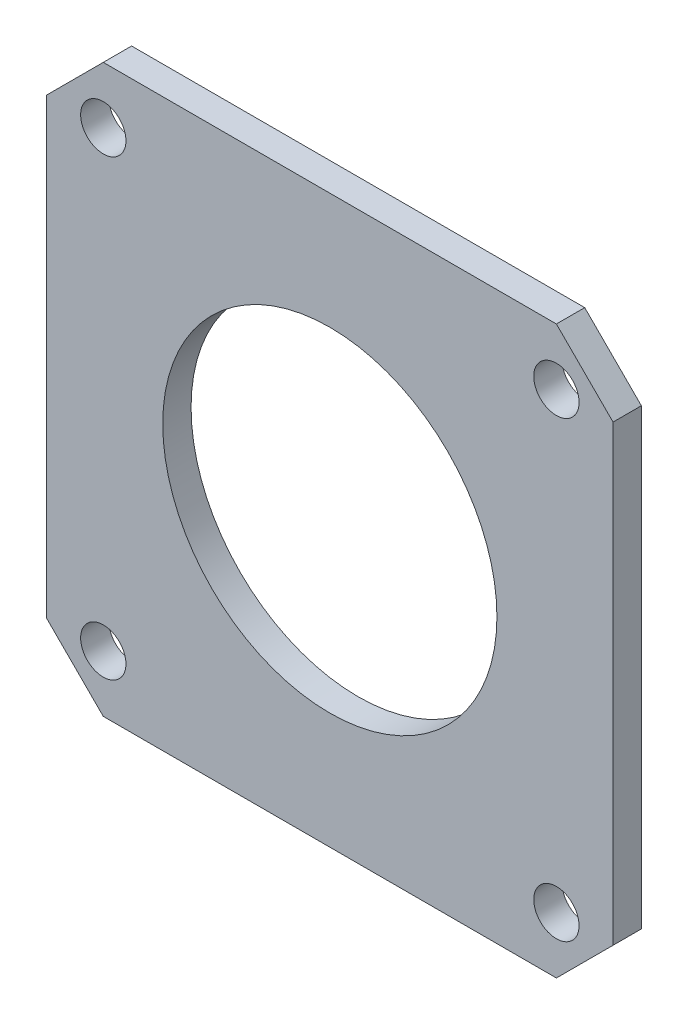
ISO-10303-21;
HEADER;
FILE_DESCRIPTION(('STEP AP214'),'2;1');
FILE_NAME('part.step','',(''),(''),'','','');
FILE_SCHEMA(('AUTOMOTIVE_DESIGN { 1 0 10303 214 1 1 1 1 }'));
ENDSEC;
DATA;
#1=APPLICATION_CONTEXT('core data for automotive mechanical design processes');
#2=APPLICATION_PROTOCOL_DEFINITION('international standard','automotive_design',2000,#1);
#3=PRODUCT_CONTEXT('',#1,'mechanical');
#4=PRODUCT('Part','Part','',(#3));
#5=PRODUCT_RELATED_PRODUCT_CATEGORY('part','',(#4));
#6=PRODUCT_DEFINITION_FORMATION('','',#4);
#7=PRODUCT_DEFINITION_CONTEXT('part definition',#1,'design');
#8=PRODUCT_DEFINITION('design','',#6,#7);
#9=PRODUCT_DEFINITION_SHAPE('','',#8);
#10=(LENGTH_UNIT() NAMED_UNIT(*) SI_UNIT(.MILLI.,.METRE.));
#11=(NAMED_UNIT(*) PLANE_ANGLE_UNIT() SI_UNIT($,.RADIAN.));
#12=(NAMED_UNIT(*) SI_UNIT($,.STERADIAN.) SOLID_ANGLE_UNIT());
#13=UNCERTAINTY_MEASURE_WITH_UNIT(LENGTH_MEASURE(1.E-05),#10,'distance_accuracy_value','');
#14=(GEOMETRIC_REPRESENTATION_CONTEXT(3) GLOBAL_UNCERTAINTY_ASSIGNED_CONTEXT((#13)) GLOBAL_UNIT_ASSIGNED_CONTEXT((#10,
#11,#12)) REPRESENTATION_CONTEXT('',''));
#15=CARTESIAN_POINT('',(0.,0.,0.));
#16=DIRECTION('',(0.,0.,1.));
#17=DIRECTION('',(1.,0.,0.));
#18=AXIS2_PLACEMENT_3D('',#15,#16,#17);
#19=CARTESIAN_POINT('',(0.,0.,5.));
#20=DIRECTION('',(0.,0.,1.));
#21=DIRECTION('',(1.,0.,0.));
#22=AXIS2_PLACEMENT_3D('',#19,#20,#21);
#23=PLANE('',#22);
#24=CARTESIAN_POINT('',(40.,-40.,5.));
#25=DIRECTION('',(0.,0.,1.));
#26=DIRECTION('',(1.,0.,0.));
#27=AXIS2_PLACEMENT_3D('',#24,#25,#26);
#28=CIRCLE('',#27,4.00000000000001);
#29=CARTESIAN_POINT('',(44.,-40.,5.));
#30=VERTEX_POINT('',#29);
#31=EDGE_CURVE('E202',#30,#30,#28,.T.);
#32=ORIENTED_EDGE('',*,*,#31,.F.);
#33=EDGE_LOOP('',(#32));
#34=FACE_BOUND('',#33,.T.);
#35=CARTESIAN_POINT('',(-40.,40.,5.));
#36=DIRECTION('',(0.,0.,1.));
#37=DIRECTION('',(1.,0.,0.));
#38=AXIS2_PLACEMENT_3D('',#35,#36,#37);
#39=CIRCLE('',#38,4.00000000000001);
#40=CARTESIAN_POINT('',(-36.,40.,5.));
#41=VERTEX_POINT('',#40);
#42=EDGE_CURVE('E190',#41,#41,#39,.T.);
#43=ORIENTED_EDGE('',*,*,#42,.F.);
#44=EDGE_LOOP('',(#43));
#45=FACE_BOUND('',#44,.T.);
#46=DIRECTION('',(0.,-1.,0.));
#47=VECTOR('',#46,1.);
#48=CARTESIAN_POINT('',(-50.,40.,5.));
#49=LINE('',#48,#47);
#50=CARTESIAN_POINT('',(-50.,40.,5.));
#51=VERTEX_POINT('',#50);
#52=CARTESIAN_POINT('',(-50.,-40.,5.));
#53=VERTEX_POINT('',#52);
#54=EDGE_CURVE('E153',#51,#53,#49,.T.);
#55=ORIENTED_EDGE('',*,*,#54,.T.);
#56=DIRECTION('',(0.707106781186548,-0.707106781186548,0.));
#57=VECTOR('',#56,1.);
#58=CARTESIAN_POINT('',(-50.,-40.,5.));
#59=LINE('',#58,#57);
#60=CARTESIAN_POINT('',(-40.,-50.,5.));
#61=VERTEX_POINT('',#60);
#62=EDGE_CURVE('E101',#53,#61,#59,.T.);
#63=ORIENTED_EDGE('',*,*,#62,.T.);
#64=DIRECTION('',(1.,0.,0.));
#65=VECTOR('',#64,1.);
#66=CARTESIAN_POINT('',(-40.,-50.,5.));
#67=LINE('',#66,#65);
#68=CARTESIAN_POINT('',(40.,-50.,5.));
#69=VERTEX_POINT('',#68);
#70=EDGE_CURVE('E168',#61,#69,#67,.T.);
#71=ORIENTED_EDGE('',*,*,#70,.T.);
#72=DIRECTION('',(0.707106781186547,0.707106781186548,0.));
#73=VECTOR('',#72,1.);
#74=CARTESIAN_POINT('',(50.,-40.,5.));
#75=LINE('',#74,#73);
#76=CARTESIAN_POINT('',(50.,-40.,5.));
#77=VERTEX_POINT('',#76);
#78=EDGE_CURVE('E181',#69,#77,#75,.T.);
#79=ORIENTED_EDGE('',*,*,#78,.T.);
#80=DIRECTION('',(0.,1.,0.));
#81=VECTOR('',#80,1.);
#82=CARTESIAN_POINT('',(50.,40.,5.));
#83=LINE('',#82,#81);
#84=CARTESIAN_POINT('',(50.,40.,5.));
#85=VERTEX_POINT('',#84);
#86=EDGE_CURVE('E120',#77,#85,#83,.T.);
#87=ORIENTED_EDGE('',*,*,#86,.T.);
#88=DIRECTION('',(-0.707106781186548,0.707106781186547,0.));
#89=VECTOR('',#88,1.);
#90=CARTESIAN_POINT('',(40.,50.,5.));
#91=LINE('',#90,#89);
#92=CARTESIAN_POINT('',(40.,50.,5.));
#93=VERTEX_POINT('',#92);
#94=EDGE_CURVE('E114',#85,#93,#91,.T.);
#95=ORIENTED_EDGE('',*,*,#94,.T.);
#96=DIRECTION('',(-1.,0.,0.));
#97=VECTOR('',#96,1.);
#98=CARTESIAN_POINT('',(-40.,50.,5.));
#99=LINE('',#98,#97);
#100=CARTESIAN_POINT('',(-40.,50.,5.));
#101=VERTEX_POINT('',#100);
#102=EDGE_CURVE('E118',#93,#101,#99,.T.);
#103=ORIENTED_EDGE('',*,*,#102,.T.);
#104=DIRECTION('',(-0.707106781186548,-0.707106781186548,0.));
#105=VECTOR('',#104,1.);
#106=CARTESIAN_POINT('',(-40.,50.,5.));
#107=LINE('',#106,#105);
#108=EDGE_CURVE('E58',#101,#51,#107,.T.);
#109=ORIENTED_EDGE('',*,*,#108,.T.);
#110=EDGE_LOOP('',(#55,#63,#71,#79,#87,#95,#103,#109));
#111=FACE_BOUND('',#110,.T.);
#112=CARTESIAN_POINT('',(0.,0.,5.));
#113=DIRECTION('',(0.,0.,1.));
#114=DIRECTION('',(1.,0.,0.));
#115=AXIS2_PLACEMENT_3D('',#112,#113,#114);
#116=CIRCLE('',#115,29.5);
#117=CARTESIAN_POINT('',(29.5,0.,5.));
#118=VERTEX_POINT('',#117);
#119=EDGE_CURVE('E142',#118,#118,#116,.T.);
#120=ORIENTED_EDGE('',*,*,#119,.F.);
#121=EDGE_LOOP('',(#120));
#122=FACE_BOUND('',#121,.T.);
#123=CARTESIAN_POINT('',(40.,40.,5.));
#124=DIRECTION('',(0.,0.,1.));
#125=DIRECTION('',(1.,0.,0.));
#126=AXIS2_PLACEMENT_3D('',#123,#124,#125);
#127=CIRCLE('',#126,4.00000000000001);
#128=CARTESIAN_POINT('',(44.,40.,5.));
#129=VERTEX_POINT('',#128);
#130=EDGE_CURVE('E196',#129,#129,#127,.T.);
#131=ORIENTED_EDGE('',*,*,#130,.F.);
#132=EDGE_LOOP('',(#131));
#133=FACE_BOUND('',#132,.T.);
#134=CARTESIAN_POINT('',(-40.,-40.,5.));
#135=DIRECTION('',(0.,0.,1.));
#136=DIRECTION('',(1.,0.,0.));
#137=AXIS2_PLACEMENT_3D('',#134,#135,#136);
#138=CIRCLE('',#137,4.);
#139=CARTESIAN_POINT('',(-36.,-40.,5.));
#140=VERTEX_POINT('',#139);
#141=EDGE_CURVE('E208',#140,#140,#138,.T.);
#142=ORIENTED_EDGE('',*,*,#141,.F.);
#143=EDGE_LOOP('',(#142));
#144=FACE_BOUND('',#143,.T.);
#145=ADVANCED_FACE('F41',(#34,#45,#111,#122,#133,#144),#23,.T.);
#146=CARTESIAN_POINT('',(0.,0.,0.));
#147=DIRECTION('',(0.,0.,1.));
#148=DIRECTION('',(1.,0.,0.));
#149=AXIS2_PLACEMENT_3D('',#146,#147,#148);
#150=PLANE('',#149);
#151=DIRECTION('',(0.,-1.,0.));
#152=VECTOR('',#151,1.);
#153=CARTESIAN_POINT('',(-50.,40.,0.));
#154=LINE('',#153,#152);
#155=CARTESIAN_POINT('',(-50.,40.,0.));
#156=VERTEX_POINT('',#155);
#157=CARTESIAN_POINT('',(-50.,-40.,0.));
#158=VERTEX_POINT('',#157);
#159=EDGE_CURVE('E138',#156,#158,#154,.T.);
#160=ORIENTED_EDGE('',*,*,#159,.F.);
#161=DIRECTION('',(-0.707106781186548,-0.707106781186548,0.));
#162=VECTOR('',#161,1.);
#163=CARTESIAN_POINT('',(-40.,50.,0.));
#164=LINE('',#163,#162);
#165=CARTESIAN_POINT('',(-40.,50.,0.));
#166=VERTEX_POINT('',#165);
#167=EDGE_CURVE('E93',#166,#156,#164,.T.);
#168=ORIENTED_EDGE('',*,*,#167,.F.);
#169=DIRECTION('',(-1.,0.,0.));
#170=VECTOR('',#169,1.);
#171=CARTESIAN_POINT('',(-40.,50.,0.));
#172=LINE('',#171,#170);
#173=CARTESIAN_POINT('',(40.,50.,0.));
#174=VERTEX_POINT('',#173);
#175=EDGE_CURVE('E87',#174,#166,#172,.T.);
#176=ORIENTED_EDGE('',*,*,#175,.F.);
#177=DIRECTION('',(-0.707106781186548,0.707106781186547,0.));
#178=VECTOR('',#177,1.);
#179=CARTESIAN_POINT('',(40.,50.,0.));
#180=LINE('',#179,#178);
#181=CARTESIAN_POINT('',(50.,40.,0.));
#182=VERTEX_POINT('',#181);
#183=EDGE_CURVE('E128',#182,#174,#180,.T.);
#184=ORIENTED_EDGE('',*,*,#183,.F.);
#185=DIRECTION('',(0.,1.,0.));
#186=VECTOR('',#185,1.);
#187=CARTESIAN_POINT('',(50.,40.,0.));
#188=LINE('',#187,#186);
#189=CARTESIAN_POINT('',(50.,-40.,0.));
#190=VERTEX_POINT('',#189);
#191=EDGE_CURVE('E148',#190,#182,#188,.T.);
#192=ORIENTED_EDGE('',*,*,#191,.F.);
#193=DIRECTION('',(0.707106781186547,0.707106781186548,0.));
#194=VECTOR('',#193,1.);
#195=CARTESIAN_POINT('',(50.,-40.,0.));
#196=LINE('',#195,#194);
#197=CARTESIAN_POINT('',(40.,-50.,0.));
#198=VERTEX_POINT('',#197);
#199=EDGE_CURVE('E146',#198,#190,#196,.T.);
#200=ORIENTED_EDGE('',*,*,#199,.F.);
#201=DIRECTION('',(1.,0.,0.));
#202=VECTOR('',#201,1.);
#203=CARTESIAN_POINT('',(-40.,-50.,0.));
#204=LINE('',#203,#202);
#205=CARTESIAN_POINT('',(-40.,-50.,0.));
#206=VERTEX_POINT('',#205);
#207=EDGE_CURVE('E144',#206,#198,#204,.T.);
#208=ORIENTED_EDGE('',*,*,#207,.F.);
#209=DIRECTION('',(0.707106781186548,-0.707106781186548,0.));
#210=VECTOR('',#209,1.);
#211=CARTESIAN_POINT('',(-50.,-40.,0.));
#212=LINE('',#211,#210);
#213=EDGE_CURVE('E141',#158,#206,#212,.T.);
#214=ORIENTED_EDGE('',*,*,#213,.F.);
#215=EDGE_LOOP('',(#160,#168,#176,#184,#192,#200,#208,#214));
#216=FACE_BOUND('',#215,.T.);
#217=CARTESIAN_POINT('',(0.,0.,0.));
#218=DIRECTION('',(0.,0.,1.));
#219=DIRECTION('',(1.,0.,0.));
#220=AXIS2_PLACEMENT_3D('',#217,#218,#219);
#221=CIRCLE('',#220,29.5);
#222=CARTESIAN_POINT('',(29.5,0.,0.));
#223=VERTEX_POINT('',#222);
#224=EDGE_CURVE('E187',#223,#223,#221,.T.);
#225=ORIENTED_EDGE('',*,*,#224,.T.);
#226=EDGE_LOOP('',(#225));
#227=FACE_BOUND('',#226,.T.);
#228=CARTESIAN_POINT('',(-40.,40.,0.));
#229=DIRECTION('',(0.,0.,1.));
#230=DIRECTION('',(1.,0.,0.));
#231=AXIS2_PLACEMENT_3D('',#228,#229,#230);
#232=CIRCLE('',#231,4.00000000000001);
#233=CARTESIAN_POINT('',(-36.,40.,0.));
#234=VERTEX_POINT('',#233);
#235=EDGE_CURVE('E193',#234,#234,#232,.T.);
#236=ORIENTED_EDGE('',*,*,#235,.T.);
#237=EDGE_LOOP('',(#236));
#238=FACE_BOUND('',#237,.T.);
#239=CARTESIAN_POINT('',(40.,40.,0.));
#240=DIRECTION('',(0.,0.,1.));
#241=DIRECTION('',(1.,0.,0.));
#242=AXIS2_PLACEMENT_3D('',#239,#240,#241);
#243=CIRCLE('',#242,4.00000000000001);
#244=CARTESIAN_POINT('',(44.,40.,0.));
#245=VERTEX_POINT('',#244);
#246=EDGE_CURVE('E199',#245,#245,#243,.T.);
#247=ORIENTED_EDGE('',*,*,#246,.T.);
#248=EDGE_LOOP('',(#247));
#249=FACE_BOUND('',#248,.T.);
#250=CARTESIAN_POINT('',(40.,-40.,0.));
#251=DIRECTION('',(0.,0.,1.));
#252=DIRECTION('',(1.,0.,0.));
#253=AXIS2_PLACEMENT_3D('',#250,#251,#252);
#254=CIRCLE('',#253,4.00000000000001);
#255=CARTESIAN_POINT('',(44.,-40.,0.));
#256=VERTEX_POINT('',#255);
#257=EDGE_CURVE('E205',#256,#256,#254,.T.);
#258=ORIENTED_EDGE('',*,*,#257,.T.);
#259=EDGE_LOOP('',(#258));
#260=FACE_BOUND('',#259,.T.);
#261=CARTESIAN_POINT('',(-40.,-40.,0.));
#262=DIRECTION('',(0.,0.,1.));
#263=DIRECTION('',(1.,0.,0.));
#264=AXIS2_PLACEMENT_3D('',#261,#262,#263);
#265=CIRCLE('',#264,4.);
#266=CARTESIAN_POINT('',(-36.,-40.,0.));
#267=VERTEX_POINT('',#266);
#268=EDGE_CURVE('E211',#267,#267,#265,.T.);
#269=ORIENTED_EDGE('',*,*,#268,.T.);
#270=EDGE_LOOP('',(#269));
#271=FACE_BOUND('',#270,.T.);
#272=ADVANCED_FACE('F172',(#216,#227,#238,#249,#260,#271),#150,.F.);
#273=CARTESIAN_POINT('',(-50.,40.,5.));
#274=DIRECTION('',(1.,0.,0.));
#275=DIRECTION('',(0.,1.,0.));
#276=AXIS2_PLACEMENT_3D('',#273,#274,#275);
#277=PLANE('',#276);
#278=ORIENTED_EDGE('',*,*,#159,.T.);
#279=DIRECTION('',(0.,0.,-1.));
#280=VECTOR('',#279,1.);
#281=CARTESIAN_POINT('',(-50.,-40.,5.));
#282=LINE('',#281,#280);
#283=EDGE_CURVE('E11',#53,#158,#282,.T.);
#284=ORIENTED_EDGE('',*,*,#283,.F.);
#285=ORIENTED_EDGE('',*,*,#54,.F.);
#286=DIRECTION('',(0.,0.,-1.));
#287=VECTOR('',#286,1.);
#288=CARTESIAN_POINT('',(-50.,40.,5.));
#289=LINE('',#288,#287);
#290=EDGE_CURVE('E134',#51,#156,#289,.T.);
#291=ORIENTED_EDGE('',*,*,#290,.T.);
#292=EDGE_LOOP('',(#278,#284,#285,#291));
#293=FACE_BOUND('',#292,.T.);
#294=ADVANCED_FACE('F43',(#293),#277,.F.);
#295=CARTESIAN_POINT('',(-50.,-40.,5.));
#296=DIRECTION('',(0.707106781186548,0.707106781186548,0.));
#297=DIRECTION('',(-0.707106781186548,0.707106781186548,0.));
#298=AXIS2_PLACEMENT_3D('',#295,#296,#297);
#299=PLANE('',#298);
#300=ORIENTED_EDGE('',*,*,#213,.T.);
#301=DIRECTION('',(0.,0.,-1.));
#302=VECTOR('',#301,1.);
#303=CARTESIAN_POINT('',(-40.,-50.,5.));
#304=LINE('',#303,#302);
#305=EDGE_CURVE('E50',#61,#206,#304,.T.);
#306=ORIENTED_EDGE('',*,*,#305,.F.);
#307=ORIENTED_EDGE('',*,*,#62,.F.);
#308=ORIENTED_EDGE('',*,*,#283,.T.);
#309=EDGE_LOOP('',(#300,#306,#307,#308));
#310=FACE_BOUND('',#309,.T.);
#311=ADVANCED_FACE('F245',(#310),#299,.F.);
#312=CARTESIAN_POINT('',(-40.,-50.,5.));
#313=DIRECTION('',(0.,1.,0.));
#314=DIRECTION('',(-1.,0.,0.));
#315=AXIS2_PLACEMENT_3D('',#312,#313,#314);
#316=PLANE('',#315);
#317=ORIENTED_EDGE('',*,*,#207,.T.);
#318=DIRECTION('',(0.,0.,-1.));
#319=VECTOR('',#318,1.);
#320=CARTESIAN_POINT('',(40.,-50.,5.));
#321=LINE('',#320,#319);
#322=EDGE_CURVE('E160',#69,#198,#321,.T.);
#323=ORIENTED_EDGE('',*,*,#322,.F.);
#324=ORIENTED_EDGE('',*,*,#70,.F.);
#325=ORIENTED_EDGE('',*,*,#305,.T.);
#326=EDGE_LOOP('',(#317,#323,#324,#325));
#327=FACE_BOUND('',#326,.T.);
#328=ADVANCED_FACE('F166',(#327),#316,.F.);
#329=CARTESIAN_POINT('',(50.,-40.,5.));
#330=DIRECTION('',(-0.707106781186548,0.707106781186547,0.));
#331=DIRECTION('',(-0.707106781186547,-0.707106781186548,0.));
#332=AXIS2_PLACEMENT_3D('',#329,#330,#331);
#333=PLANE('',#332);
#334=ORIENTED_EDGE('',*,*,#199,.T.);
#335=DIRECTION('',(0.,0.,-1.));
#336=VECTOR('',#335,1.);
#337=CARTESIAN_POINT('',(50.,-40.,5.));
#338=LINE('',#337,#336);
#339=EDGE_CURVE('E157',#77,#190,#338,.T.);
#340=ORIENTED_EDGE('',*,*,#339,.F.);
#341=ORIENTED_EDGE('',*,*,#78,.F.);
#342=ORIENTED_EDGE('',*,*,#322,.T.);
#343=EDGE_LOOP('',(#334,#340,#341,#342));
#344=FACE_BOUND('',#343,.T.);
#345=ADVANCED_FACE('F177',(#344),#333,.F.);
#346=CARTESIAN_POINT('',(50.,40.,5.));
#347=DIRECTION('',(-1.,0.,0.));
#348=DIRECTION('',(0.,-1.,0.));
#349=AXIS2_PLACEMENT_3D('',#346,#347,#348);
#350=PLANE('',#349);
#351=ORIENTED_EDGE('',*,*,#191,.T.);
#352=DIRECTION('',(0.,0.,-1.));
#353=VECTOR('',#352,1.);
#354=CARTESIAN_POINT('',(50.,40.,5.));
#355=LINE('',#354,#353);
#356=EDGE_CURVE('E129',#85,#182,#355,.T.);
#357=ORIENTED_EDGE('',*,*,#356,.F.);
#358=ORIENTED_EDGE('',*,*,#86,.F.);
#359=ORIENTED_EDGE('',*,*,#339,.T.);
#360=EDGE_LOOP('',(#351,#357,#358,#359));
#361=FACE_BOUND('',#360,.T.);
#362=ADVANCED_FACE('F180',(#361),#350,.F.);
#363=CARTESIAN_POINT('',(40.,50.,5.));
#364=DIRECTION('',(-0.707106781186547,-0.707106781186548,0.));
#365=DIRECTION('',(0.707106781186548,-0.707106781186547,0.));
#366=AXIS2_PLACEMENT_3D('',#363,#364,#365);
#367=PLANE('',#366);
#368=ORIENTED_EDGE('',*,*,#183,.T.);
#369=DIRECTION('',(0.,0.,-1.));
#370=VECTOR('',#369,1.);
#371=CARTESIAN_POINT('',(40.,50.,5.));
#372=LINE('',#371,#370);
#373=EDGE_CURVE('E125',#93,#174,#372,.T.);
#374=ORIENTED_EDGE('',*,*,#373,.F.);
#375=ORIENTED_EDGE('',*,*,#94,.F.);
#376=ORIENTED_EDGE('',*,*,#356,.T.);
#377=EDGE_LOOP('',(#368,#374,#375,#376));
#378=FACE_BOUND('',#377,.T.);
#379=ADVANCED_FACE('F126',(#378),#367,.F.);
#380=CARTESIAN_POINT('',(-40.,50.,5.));
#381=DIRECTION('',(0.,-1.,0.));
#382=DIRECTION('',(0.,0.,-1.));
#383=AXIS2_PLACEMENT_3D('',#380,#381,#382);
#384=PLANE('',#383);
#385=ORIENTED_EDGE('',*,*,#175,.T.);
#386=DIRECTION('',(0.,0.,-1.));
#387=VECTOR('',#386,1.);
#388=CARTESIAN_POINT('',(-40.,50.,5.));
#389=LINE('',#388,#387);
#390=EDGE_CURVE('E130',#101,#166,#389,.T.);
#391=ORIENTED_EDGE('',*,*,#390,.F.);
#392=ORIENTED_EDGE('',*,*,#102,.F.);
#393=ORIENTED_EDGE('',*,*,#373,.T.);
#394=EDGE_LOOP('',(#385,#391,#392,#393));
#395=FACE_BOUND('',#394,.T.);
#396=ADVANCED_FACE('F132',(#395),#384,.F.);
#397=CARTESIAN_POINT('',(-40.,50.,5.));
#398=DIRECTION('',(0.707106781186548,-0.707106781186548,0.));
#399=DIRECTION('',(0.707106781186548,0.707106781186548,0.));
#400=AXIS2_PLACEMENT_3D('',#397,#398,#399);
#401=PLANE('',#400);
#402=ORIENTED_EDGE('',*,*,#167,.T.);
#403=ORIENTED_EDGE('',*,*,#290,.F.);
#404=ORIENTED_EDGE('',*,*,#108,.F.);
#405=ORIENTED_EDGE('',*,*,#390,.T.);
#406=EDGE_LOOP('',(#402,#403,#404,#405));
#407=FACE_BOUND('',#406,.T.);
#408=ADVANCED_FACE('F233',(#407),#401,.F.);
#409=CARTESIAN_POINT('',(0.,0.,5.));
#410=DIRECTION('',(0.,0.,-1.));
#411=DIRECTION('',(-1.,0.,0.));
#412=AXIS2_PLACEMENT_3D('',#409,#410,#411);
#413=CYLINDRICAL_SURFACE('',#412,29.5);
#414=ORIENTED_EDGE('',*,*,#119,.T.);
#415=EDGE_LOOP('',(#414));
#416=FACE_BOUND('',#415,.T.);
#417=ORIENTED_EDGE('',*,*,#224,.F.);
#418=EDGE_LOOP('',(#417));
#419=FACE_BOUND('',#418,.T.);
#420=ADVANCED_FACE('F230',(#416,#419),#413,.F.);
#421=CARTESIAN_POINT('',(-40.,40.,5.));
#422=DIRECTION('',(0.,0.,-1.));
#423=DIRECTION('',(-1.,0.,0.));
#424=AXIS2_PLACEMENT_3D('',#421,#422,#423);
#425=CYLINDRICAL_SURFACE('',#424,4.00000000000001);
#426=ORIENTED_EDGE('',*,*,#42,.T.);
#427=EDGE_LOOP('',(#426));
#428=FACE_BOUND('',#427,.T.);
#429=ORIENTED_EDGE('',*,*,#235,.F.);
#430=EDGE_LOOP('',(#429));
#431=FACE_BOUND('',#430,.T.);
#432=ADVANCED_FACE('F321',(#428,#431),#425,.F.);
#433=CARTESIAN_POINT('',(40.,40.,5.));
#434=DIRECTION('',(0.,0.,-1.));
#435=DIRECTION('',(-1.,0.,0.));
#436=AXIS2_PLACEMENT_3D('',#433,#434,#435);
#437=CYLINDRICAL_SURFACE('',#436,4.00000000000001);
#438=ORIENTED_EDGE('',*,*,#130,.T.);
#439=EDGE_LOOP('',(#438));
#440=FACE_BOUND('',#439,.T.);
#441=ORIENTED_EDGE('',*,*,#246,.F.);
#442=EDGE_LOOP('',(#441));
#443=FACE_BOUND('',#442,.T.);
#444=ADVANCED_FACE('F330',(#440,#443),#437,.F.);
#445=CARTESIAN_POINT('',(40.,-40.,5.));
#446=DIRECTION('',(0.,0.,-1.));
#447=DIRECTION('',(-1.,0.,0.));
#448=AXIS2_PLACEMENT_3D('',#445,#446,#447);
#449=CYLINDRICAL_SURFACE('',#448,4.00000000000001);
#450=ORIENTED_EDGE('',*,*,#31,.T.);
#451=EDGE_LOOP('',(#450));
#452=FACE_BOUND('',#451,.T.);
#453=ORIENTED_EDGE('',*,*,#257,.F.);
#454=EDGE_LOOP('',(#453));
#455=FACE_BOUND('',#454,.T.);
#456=ADVANCED_FACE('F339',(#452,#455),#449,.F.);
#457=CARTESIAN_POINT('',(-40.,-40.,5.));
#458=DIRECTION('',(0.,0.,-1.));
#459=DIRECTION('',(-1.,0.,0.));
#460=AXIS2_PLACEMENT_3D('',#457,#458,#459);
#461=CYLINDRICAL_SURFACE('',#460,4.);
#462=ORIENTED_EDGE('',*,*,#141,.T.);
#463=EDGE_LOOP('',(#462));
#464=FACE_BOUND('',#463,.T.);
#465=ORIENTED_EDGE('',*,*,#268,.F.);
#466=EDGE_LOOP('',(#465));
#467=FACE_BOUND('',#466,.T.);
#468=ADVANCED_FACE('F217',(#464,#467),#461,.F.);
#469=CLOSED_SHELL('',(#145,#272,#294,#311,#328,#345,#362,#379,#396,#408,#420,#432,#444,#456,#468));
#470=MANIFOLD_SOLID_BREP('B2',#469);
#471=ADVANCED_BREP_SHAPE_REPRESENTATION('',(#18,#470),#14);
#472=SHAPE_DEFINITION_REPRESENTATION(#9,#471);
ENDSEC;
END-ISO-10303-21;
